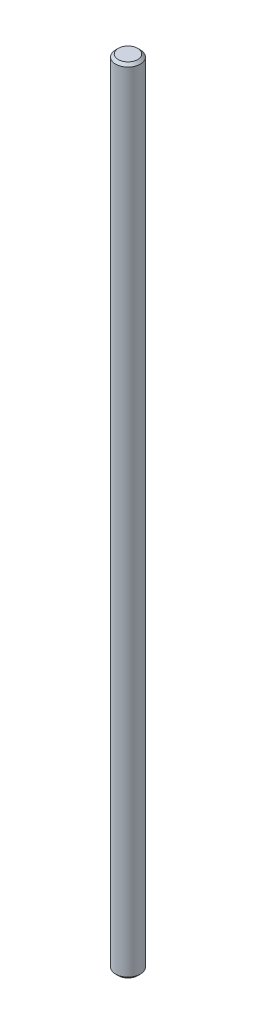
ISO-10303-21;
HEADER;
FILE_DESCRIPTION(('STEP AP214'),'2;1');
FILE_NAME('part.step','',(''),(''),'','','');
FILE_SCHEMA(('AUTOMOTIVE_DESIGN { 1 0 10303 214 1 1 1 1 }'));
ENDSEC;
DATA;
#1=APPLICATION_CONTEXT('core data for automotive mechanical design processes');
#2=APPLICATION_PROTOCOL_DEFINITION('international standard','automotive_design',2000,#1);
#3=PRODUCT_CONTEXT('',#1,'mechanical');
#4=PRODUCT('Part','Part','',(#3));
#5=PRODUCT_RELATED_PRODUCT_CATEGORY('part','',(#4));
#6=PRODUCT_DEFINITION_FORMATION('','',#4);
#7=PRODUCT_DEFINITION_CONTEXT('part definition',#1,'design');
#8=PRODUCT_DEFINITION('design','',#6,#7);
#9=PRODUCT_DEFINITION_SHAPE('','',#8);
#10=(LENGTH_UNIT() NAMED_UNIT(*) SI_UNIT(.MILLI.,.METRE.));
#11=(NAMED_UNIT(*) PLANE_ANGLE_UNIT() SI_UNIT($,.RADIAN.));
#12=(NAMED_UNIT(*) SI_UNIT($,.STERADIAN.) SOLID_ANGLE_UNIT());
#13=UNCERTAINTY_MEASURE_WITH_UNIT(LENGTH_MEASURE(1.E-05),#10,'distance_accuracy_value','');
#14=(GEOMETRIC_REPRESENTATION_CONTEXT(3) GLOBAL_UNCERTAINTY_ASSIGNED_CONTEXT((#13)) GLOBAL_UNIT_ASSIGNED_CONTEXT((#10,
#11,#12)) REPRESENTATION_CONTEXT('',''));
#15=CARTESIAN_POINT('',(0.,0.,0.));
#16=DIRECTION('',(0.,0.,1.));
#17=DIRECTION('',(1.,0.,0.));
#18=AXIS2_PLACEMENT_3D('',#15,#16,#17);
#19=CARTESIAN_POINT('',(0.,0.,0.));
#20=DIRECTION('',(0.,1.,0.));
#21=DIRECTION('',(1.,0.,0.));
#22=AXIS2_PLACEMENT_3D('',#19,#20,#21);
#23=PLANE('',#22);
#24=CARTESIAN_POINT('',(0.,0.,0.));
#25=DIRECTION('',(0.,-1.,0.));
#26=DIRECTION('',(0.,0.,1.));
#27=AXIS2_PLACEMENT_3D('',#24,#25,#26);
#28=CIRCLE('',#27,1.86943999999984);
#29=CARTESIAN_POINT('',(0.,0.,1.86943999999984));
#30=VERTEX_POINT('',#29);
#31=EDGE_CURVE('E22',#30,#30,#28,.T.);
#32=ORIENTED_EDGE('',*,*,#31,.T.);
#33=EDGE_LOOP('',(#32));
#34=FACE_BOUND('',#33,.T.);
#35=ADVANCED_FACE('F15',(#34),#23,.F.);
#36=CARTESIAN_POINT('',(0.,152.4,0.));
#37=DIRECTION('',(0.,1.,0.));
#38=DIRECTION('',(1.,0.,0.));
#39=AXIS2_PLACEMENT_3D('',#36,#37,#38);
#40=PLANE('',#39);
#41=CARTESIAN_POINT('',(0.,152.4,0.));
#42=DIRECTION('',(0.,1.,0.));
#43=DIRECTION('',(0.,0.,1.));
#44=AXIS2_PLACEMENT_3D('',#41,#42,#43);
#45=CIRCLE('',#44,1.86944000000009);
#46=CARTESIAN_POINT('',(0.,152.4,1.86944000000009));
#47=VERTEX_POINT('',#46);
#48=EDGE_CURVE('E38',#47,#47,#45,.T.);
#49=ORIENTED_EDGE('',*,*,#48,.T.);
#50=EDGE_LOOP('',(#49));
#51=FACE_BOUND('',#50,.T.);
#52=ADVANCED_FACE('F47',(#51),#40,.T.);
#53=CARTESIAN_POINT('',(0.,152.4,0.));
#54=DIRECTION('',(0.,-1.,0.));
#55=DIRECTION('',(0.,0.,-1.));
#56=AXIS2_PLACEMENT_3D('',#53,#54,#55);
#57=CYLINDRICAL_SURFACE('',#56,2.37744);
#58=CARTESIAN_POINT('',(0.,0.508000000000175,0.));
#59=DIRECTION('',(0.,1.,0.));
#60=DIRECTION('',(0.,0.,1.));
#61=AXIS2_PLACEMENT_3D('',#58,#59,#60);
#62=CIRCLE('',#61,2.37744);
#63=CARTESIAN_POINT('',(0.,0.508000000000175,2.37744));
#64=VERTEX_POINT('',#63);
#65=EDGE_CURVE('E10',#64,#64,#62,.T.);
#66=ORIENTED_EDGE('',*,*,#65,.T.);
#67=EDGE_LOOP('',(#66));
#68=FACE_BOUND('',#67,.T.);
#69=CARTESIAN_POINT('',(0.,151.892,0.));
#70=DIRECTION('',(0.,-1.,0.));
#71=DIRECTION('',(0.,0.,1.));
#72=AXIS2_PLACEMENT_3D('',#69,#70,#71);
#73=CIRCLE('',#72,2.37744);
#74=CARTESIAN_POINT('',(0.,151.892,2.37744));
#75=VERTEX_POINT('',#74);
#76=EDGE_CURVE('E31',#75,#75,#73,.T.);
#77=ORIENTED_EDGE('',*,*,#76,.T.);
#78=EDGE_LOOP('',(#77));
#79=FACE_BOUND('',#78,.T.);
#80=ADVANCED_FACE('F58',(#68,#79),#57,.T.);
#81=CARTESIAN_POINT('',(0.,0.508000000000175,0.));
#82=DIRECTION('',(0.,1.,0.));
#83=DIRECTION('',(0.,0.,1.));
#84=AXIS2_PLACEMENT_3D('',#81,#82,#83);
#85=CONICAL_SURFACE('',#84,2.37744,0.785398163397441);
#86=ORIENTED_EDGE('',*,*,#65,.F.);
#87=EDGE_LOOP('',(#86));
#88=FACE_BOUND('',#87,.T.);
#89=ORIENTED_EDGE('',*,*,#31,.F.);
#90=EDGE_LOOP('',(#89));
#91=FACE_BOUND('',#90,.T.);
#92=ADVANCED_FACE('F51',(#88,#91),#85,.T.);
#93=CARTESIAN_POINT('',(0.,152.4,0.));
#94=DIRECTION('',(0.,-1.,0.));
#95=DIRECTION('',(0.,0.,-1.));
#96=AXIS2_PLACEMENT_3D('',#93,#94,#95);
#97=CONICAL_SURFACE('',#96,1.86944000000009,0.785398163397441);
#98=ORIENTED_EDGE('',*,*,#76,.F.);
#99=EDGE_LOOP('',(#98));
#100=FACE_BOUND('',#99,.T.);
#101=ORIENTED_EDGE('',*,*,#48,.F.);
#102=EDGE_LOOP('',(#101));
#103=FACE_BOUND('',#102,.T.);
#104=ADVANCED_FACE('F49',(#100,#103),#97,.T.);
#105=CLOSED_SHELL('',(#35,#52,#80,#92,#104));
#106=MANIFOLD_SOLID_BREP('B1',#105);
#107=ADVANCED_BREP_SHAPE_REPRESENTATION('',(#18,#106),#14);
#108=SHAPE_DEFINITION_REPRESENTATION(#9,#107);
ENDSEC;
END-ISO-10303-21;
